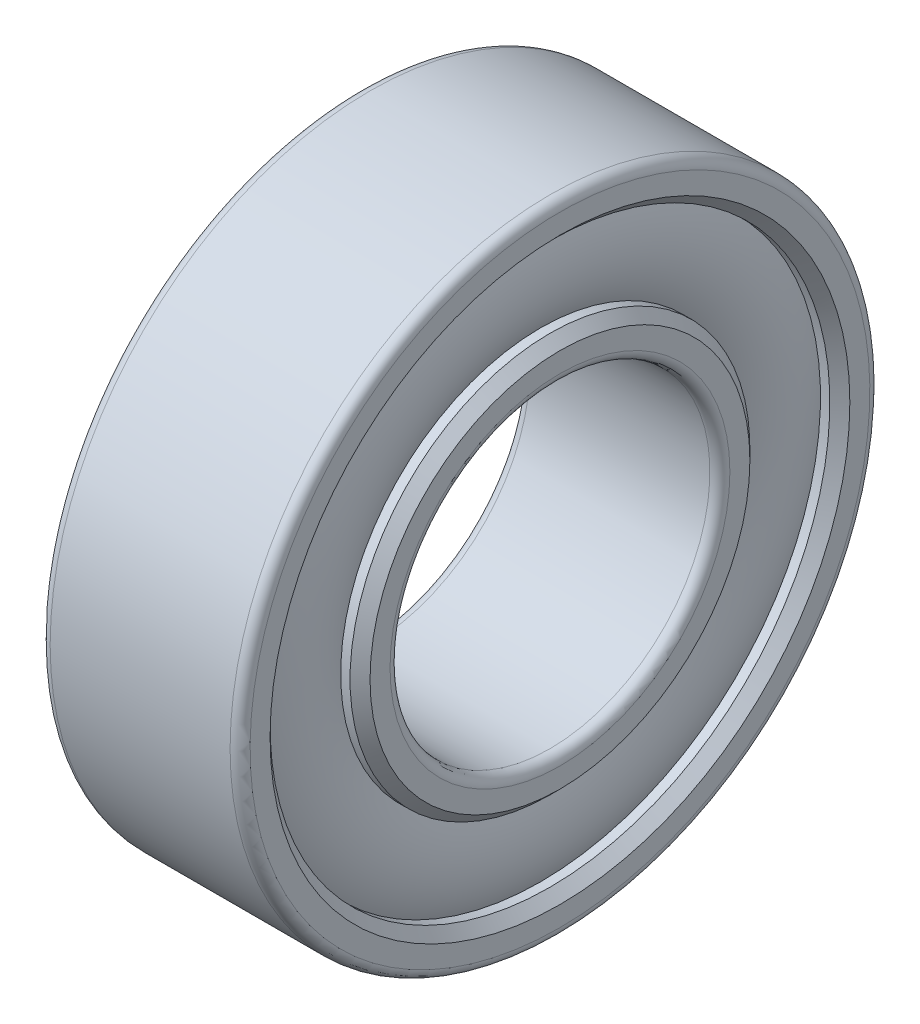
ISO-10303-21;
HEADER;
FILE_DESCRIPTION(('STEP AP214'),'2;1');
FILE_NAME('part.step','',(''),(''),'','','');
FILE_SCHEMA(('AUTOMOTIVE_DESIGN { 1 0 10303 214 1 1 1 1 }'));
ENDSEC;
DATA;
#1=APPLICATION_CONTEXT('core data for automotive mechanical design processes');
#2=APPLICATION_PROTOCOL_DEFINITION('international standard','automotive_design',2000,#1);
#3=PRODUCT_CONTEXT('',#1,'mechanical');
#4=PRODUCT('Part','Part','',(#3));
#5=PRODUCT_RELATED_PRODUCT_CATEGORY('part','',(#4));
#6=PRODUCT_DEFINITION_FORMATION('','',#4);
#7=PRODUCT_DEFINITION_CONTEXT('part definition',#1,'design');
#8=PRODUCT_DEFINITION('design','',#6,#7);
#9=PRODUCT_DEFINITION_SHAPE('','',#8);
#10=(LENGTH_UNIT() NAMED_UNIT(*) SI_UNIT(.MILLI.,.METRE.));
#11=(NAMED_UNIT(*) PLANE_ANGLE_UNIT() SI_UNIT($,.RADIAN.));
#12=(NAMED_UNIT(*) SI_UNIT($,.STERADIAN.) SOLID_ANGLE_UNIT());
#13=UNCERTAINTY_MEASURE_WITH_UNIT(LENGTH_MEASURE(1.E-05),#10,'distance_accuracy_value','');
#14=(GEOMETRIC_REPRESENTATION_CONTEXT(3) GLOBAL_UNCERTAINTY_ASSIGNED_CONTEXT((#13)) GLOBAL_UNIT_ASSIGNED_CONTEXT((#10,
#11,#12)) REPRESENTATION_CONTEXT('',''));
#15=CARTESIAN_POINT('',(0.,0.,0.));
#16=DIRECTION('',(0.,0.,1.));
#17=DIRECTION('',(1.,0.,0.));
#18=AXIS2_PLACEMENT_3D('',#15,#16,#17);
#19=CARTESIAN_POINT('',(2.5,0.,0.));
#20=DIRECTION('',(-1.,0.,0.));
#21=DIRECTION('',(0.,-1.,0.));
#22=AXIS2_PLACEMENT_3D('',#19,#20,#21);
#23=TOROIDAL_SURFACE('',#22,6.,2.25);
#24=CARTESIAN_POINT('',(0.484435562925364,0.,0.));
#25=DIRECTION('',(-1.,0.,0.));
#26=DIRECTION('',(0.,-1.,0.));
#27=AXIS2_PLACEMENT_3D('',#24,#25,#26);
#28=CIRCLE('',#27,7.);
#29=CARTESIAN_POINT('',(0.484435562925363,-7.,0.));
#30=VERTEX_POINT('',#29);
#31=EDGE_CURVE('E10',#30,#30,#28,.T.);
#32=ORIENTED_EDGE('',*,*,#31,.T.);
#33=EDGE_LOOP('',(#32));
#34=FACE_BOUND('',#33,.T.);
#35=CARTESIAN_POINT('',(0.484435562925364,0.,0.));
#36=DIRECTION('',(-1.,0.,0.));
#37=DIRECTION('',(0.,-1.,0.));
#38=AXIS2_PLACEMENT_3D('',#35,#36,#37);
#39=CIRCLE('',#38,5.);
#40=CARTESIAN_POINT('',(0.484435562925363,-5.,0.));
#41=VERTEX_POINT('',#40);
#42=EDGE_CURVE('E97',#41,#41,#39,.T.);
#43=ORIENTED_EDGE('',*,*,#42,.F.);
#44=EDGE_LOOP('',(#43));
#45=FACE_BOUND('',#44,.T.);
#46=ADVANCED_FACE('F33',(#34,#45),#23,.T.);
#47=CARTESIAN_POINT('',(0.,0.,0.));
#48=DIRECTION('',(-1.,0.,0.));
#49=DIRECTION('',(0.,-1.,0.));
#50=AXIS2_PLACEMENT_3D('',#47,#48,#49);
#51=CYLINDRICAL_SURFACE('',#50,7.);
#52=CARTESIAN_POINT('',(0.25,0.,0.));
#53=DIRECTION('',(-1.,0.,0.));
#54=DIRECTION('',(0.,-1.,0.));
#55=AXIS2_PLACEMENT_3D('',#52,#53,#54);
#56=CIRCLE('',#55,7.);
#57=CARTESIAN_POINT('',(0.25,-7.,0.));
#58=VERTEX_POINT('',#57);
#59=EDGE_CURVE('E39',#58,#58,#56,.T.);
#60=ORIENTED_EDGE('',*,*,#59,.T.);
#61=EDGE_LOOP('',(#60));
#62=FACE_BOUND('',#61,.T.);
#63=ORIENTED_EDGE('',*,*,#31,.F.);
#64=EDGE_LOOP('',(#63));
#65=FACE_BOUND('',#64,.T.);
#66=ADVANCED_FACE('F105',(#62,#65),#51,.F.);
#67=CARTESIAN_POINT('',(0.25,0.,0.));
#68=DIRECTION('',(-1.,0.,0.));
#69=DIRECTION('',(0.,-1.,0.));
#70=AXIS2_PLACEMENT_3D('',#67,#68,#69);
#71=CONICAL_SURFACE('',#70,7.,0.785398163397449);
#72=CARTESIAN_POINT('',(0.,0.,0.));
#73=DIRECTION('',(-1.,0.,0.));
#74=DIRECTION('',(0.,-1.,0.));
#75=AXIS2_PLACEMENT_3D('',#72,#73,#74);
#76=CIRCLE('',#75,7.25);
#77=CARTESIAN_POINT('',(0.,-7.25,0.));
#78=VERTEX_POINT('',#77);
#79=EDGE_CURVE('E43',#78,#78,#76,.T.);
#80=ORIENTED_EDGE('',*,*,#79,.T.);
#81=EDGE_LOOP('',(#80));
#82=FACE_BOUND('',#81,.T.);
#83=ORIENTED_EDGE('',*,*,#59,.F.);
#84=EDGE_LOOP('',(#83));
#85=FACE_BOUND('',#84,.T.);
#86=ADVANCED_FACE('F109',(#82,#85),#71,.F.);
#87=CARTESIAN_POINT('',(0.,-7.25,0.));
#88=DIRECTION('',(-1.,0.,0.));
#89=DIRECTION('',(0.,-1.,0.));
#90=AXIS2_PLACEMENT_3D('',#87,#88,#89);
#91=PLANE('',#90);
#92=CARTESIAN_POINT('',(0.,0.,0.));
#93=DIRECTION('',(-1.,0.,0.));
#94=DIRECTION('',(0.,-1.,0.));
#95=AXIS2_PLACEMENT_3D('',#92,#93,#94);
#96=CIRCLE('',#95,7.75);
#97=CARTESIAN_POINT('',(0.,-7.75,0.));
#98=VERTEX_POINT('',#97);
#99=EDGE_CURVE('E47',#98,#98,#96,.T.);
#100=ORIENTED_EDGE('',*,*,#99,.T.);
#101=EDGE_LOOP('',(#100));
#102=FACE_BOUND('',#101,.T.);
#103=ORIENTED_EDGE('',*,*,#79,.F.);
#104=EDGE_LOOP('',(#103));
#105=FACE_BOUND('',#104,.T.);
#106=ADVANCED_FACE('F113',(#102,#105),#91,.T.);
#107=CARTESIAN_POINT('',(0.25,0.,0.));
#108=DIRECTION('',(-1.,0.,0.));
#109=DIRECTION('',(0.,-1.,0.));
#110=AXIS2_PLACEMENT_3D('',#107,#108,#109);
#111=TOROIDAL_SURFACE('',#110,7.75,0.250000000000001);
#112=CARTESIAN_POINT('',(0.25,0.,0.));
#113=DIRECTION('',(-1.,0.,0.));
#114=DIRECTION('',(0.,-1.,0.));
#115=AXIS2_PLACEMENT_3D('',#112,#113,#114);
#116=CIRCLE('',#115,8.);
#117=CARTESIAN_POINT('',(0.25,-8.,0.));
#118=VERTEX_POINT('',#117);
#119=EDGE_CURVE('E52',#118,#118,#116,.T.);
#120=ORIENTED_EDGE('',*,*,#119,.T.);
#121=EDGE_LOOP('',(#120));
#122=FACE_BOUND('',#121,.T.);
#123=ORIENTED_EDGE('',*,*,#99,.F.);
#124=EDGE_LOOP('',(#123));
#125=FACE_BOUND('',#124,.T.);
#126=ADVANCED_FACE('F120',(#122,#125),#111,.T.);
#127=CARTESIAN_POINT('',(0.,0.,0.));
#128=DIRECTION('',(-1.,0.,0.));
#129=DIRECTION('',(0.,-1.,0.));
#130=AXIS2_PLACEMENT_3D('',#127,#128,#129);
#131=CYLINDRICAL_SURFACE('',#130,8.);
#132=CARTESIAN_POINT('',(4.75,0.,0.));
#133=DIRECTION('',(-1.,0.,0.));
#134=DIRECTION('',(0.,-1.,0.));
#135=AXIS2_PLACEMENT_3D('',#132,#133,#134);
#136=CIRCLE('',#135,8.);
#137=CARTESIAN_POINT('',(4.75,-8.,0.));
#138=VERTEX_POINT('',#137);
#139=EDGE_CURVE('E55',#138,#138,#136,.T.);
#140=ORIENTED_EDGE('',*,*,#139,.T.);
#141=EDGE_LOOP('',(#140));
#142=FACE_BOUND('',#141,.T.);
#143=ORIENTED_EDGE('',*,*,#119,.F.);
#144=EDGE_LOOP('',(#143));
#145=FACE_BOUND('',#144,.T.);
#146=ADVANCED_FACE('F124',(#142,#145),#131,.T.);
#147=CARTESIAN_POINT('',(4.75,0.,0.));
#148=DIRECTION('',(-1.,0.,0.));
#149=DIRECTION('',(0.,-1.,0.));
#150=AXIS2_PLACEMENT_3D('',#147,#148,#149);
#151=TOROIDAL_SURFACE('',#150,7.75,0.250000000000001);
#152=CARTESIAN_POINT('',(5.,0.,0.));
#153=DIRECTION('',(-1.,0.,0.));
#154=DIRECTION('',(0.,-1.,0.));
#155=AXIS2_PLACEMENT_3D('',#152,#153,#154);
#156=CIRCLE('',#155,7.75);
#157=CARTESIAN_POINT('',(5.,-7.75,0.));
#158=VERTEX_POINT('',#157);
#159=EDGE_CURVE('E58',#158,#158,#156,.T.);
#160=ORIENTED_EDGE('',*,*,#159,.T.);
#161=EDGE_LOOP('',(#160));
#162=FACE_BOUND('',#161,.T.);
#163=ORIENTED_EDGE('',*,*,#139,.F.);
#164=EDGE_LOOP('',(#163));
#165=FACE_BOUND('',#164,.T.);
#166=ADVANCED_FACE('F128',(#162,#165),#151,.T.);
#167=CARTESIAN_POINT('',(5.,-7.25,0.));
#168=DIRECTION('',(1.,0.,0.));
#169=DIRECTION('',(0.,1.,0.));
#170=AXIS2_PLACEMENT_3D('',#167,#168,#169);
#171=PLANE('',#170);
#172=CARTESIAN_POINT('',(5.,0.,0.));
#173=DIRECTION('',(-1.,0.,0.));
#174=DIRECTION('',(0.,-1.,0.));
#175=AXIS2_PLACEMENT_3D('',#172,#173,#174);
#176=CIRCLE('',#175,7.25);
#177=CARTESIAN_POINT('',(5.,-7.25,0.));
#178=VERTEX_POINT('',#177);
#179=EDGE_CURVE('E61',#178,#178,#176,.T.);
#180=ORIENTED_EDGE('',*,*,#179,.T.);
#181=EDGE_LOOP('',(#180));
#182=FACE_BOUND('',#181,.T.);
#183=ORIENTED_EDGE('',*,*,#159,.F.);
#184=EDGE_LOOP('',(#183));
#185=FACE_BOUND('',#184,.T.);
#186=ADVANCED_FACE('F132',(#182,#185),#171,.T.);
#187=CARTESIAN_POINT('',(5.,0.,0.));
#188=DIRECTION('',(1.,0.,0.));
#189=DIRECTION('',(0.,1.,0.));
#190=AXIS2_PLACEMENT_3D('',#187,#188,#189);
#191=CONICAL_SURFACE('',#190,7.25,0.785398163397448);
#192=CARTESIAN_POINT('',(4.75,0.,0.));
#193=DIRECTION('',(-1.,0.,0.));
#194=DIRECTION('',(0.,-1.,0.));
#195=AXIS2_PLACEMENT_3D('',#192,#193,#194);
#196=CIRCLE('',#195,7.);
#197=CARTESIAN_POINT('',(4.75,-7.,0.));
#198=VERTEX_POINT('',#197);
#199=EDGE_CURVE('E64',#198,#198,#196,.T.);
#200=ORIENTED_EDGE('',*,*,#199,.T.);
#201=EDGE_LOOP('',(#200));
#202=FACE_BOUND('',#201,.T.);
#203=ORIENTED_EDGE('',*,*,#179,.F.);
#204=EDGE_LOOP('',(#203));
#205=FACE_BOUND('',#204,.T.);
#206=ADVANCED_FACE('F136',(#202,#205),#191,.F.);
#207=CARTESIAN_POINT('',(0.,0.,0.));
#208=DIRECTION('',(-1.,0.,0.));
#209=DIRECTION('',(0.,-1.,0.));
#210=AXIS2_PLACEMENT_3D('',#207,#208,#209);
#211=CYLINDRICAL_SURFACE('',#210,7.);
#212=CARTESIAN_POINT('',(4.51556443707464,0.,0.));
#213=DIRECTION('',(-1.,0.,0.));
#214=DIRECTION('',(0.,-1.,0.));
#215=AXIS2_PLACEMENT_3D('',#212,#213,#214);
#216=CIRCLE('',#215,7.);
#217=CARTESIAN_POINT('',(4.51556443707464,-7.,0.));
#218=VERTEX_POINT('',#217);
#219=EDGE_CURVE('E67',#218,#218,#216,.T.);
#220=ORIENTED_EDGE('',*,*,#219,.T.);
#221=EDGE_LOOP('',(#220));
#222=FACE_BOUND('',#221,.T.);
#223=ORIENTED_EDGE('',*,*,#199,.F.);
#224=EDGE_LOOP('',(#223));
#225=FACE_BOUND('',#224,.T.);
#226=ADVANCED_FACE('F140',(#222,#225),#211,.F.);
#227=CARTESIAN_POINT('',(2.5,0.,0.));
#228=DIRECTION('',(-1.,0.,0.));
#229=DIRECTION('',(0.,-1.,0.));
#230=AXIS2_PLACEMENT_3D('',#227,#228,#229);
#231=TOROIDAL_SURFACE('',#230,6.,2.25);
#232=CARTESIAN_POINT('',(4.51556443707464,0.,0.));
#233=DIRECTION('',(-1.,0.,0.));
#234=DIRECTION('',(0.,-1.,0.));
#235=AXIS2_PLACEMENT_3D('',#232,#233,#234);
#236=CIRCLE('',#235,5.);
#237=CARTESIAN_POINT('',(4.51556443707464,-5.,0.));
#238=VERTEX_POINT('',#237);
#239=EDGE_CURVE('E70',#238,#238,#236,.T.);
#240=ORIENTED_EDGE('',*,*,#239,.T.);
#241=EDGE_LOOP('',(#240));
#242=FACE_BOUND('',#241,.T.);
#243=ORIENTED_EDGE('',*,*,#219,.F.);
#244=EDGE_LOOP('',(#243));
#245=FACE_BOUND('',#244,.T.);
#246=ADVANCED_FACE('F144',(#242,#245),#231,.T.);
#247=CARTESIAN_POINT('',(0.,0.,0.));
#248=DIRECTION('',(-1.,0.,0.));
#249=DIRECTION('',(0.,-1.,0.));
#250=AXIS2_PLACEMENT_3D('',#247,#248,#249);
#251=CYLINDRICAL_SURFACE('',#250,5.);
#252=CARTESIAN_POINT('',(4.75,0.,0.));
#253=DIRECTION('',(-1.,0.,0.));
#254=DIRECTION('',(0.,-1.,0.));
#255=AXIS2_PLACEMENT_3D('',#252,#253,#254);
#256=CIRCLE('',#255,5.);
#257=CARTESIAN_POINT('',(4.75,-5.,0.));
#258=VERTEX_POINT('',#257);
#259=EDGE_CURVE('E73',#258,#258,#256,.T.);
#260=ORIENTED_EDGE('',*,*,#259,.T.);
#261=EDGE_LOOP('',(#260));
#262=FACE_BOUND('',#261,.T.);
#263=ORIENTED_EDGE('',*,*,#239,.F.);
#264=EDGE_LOOP('',(#263));
#265=FACE_BOUND('',#264,.T.);
#266=ADVANCED_FACE('F148',(#262,#265),#251,.T.);
#267=CARTESIAN_POINT('',(4.75,0.,0.));
#268=DIRECTION('',(-1.,0.,0.));
#269=DIRECTION('',(0.,-1.,0.));
#270=AXIS2_PLACEMENT_3D('',#267,#268,#269);
#271=CONICAL_SURFACE('',#270,5.,0.785398163397448);
#272=CARTESIAN_POINT('',(5.,0.,0.));
#273=DIRECTION('',(-1.,0.,0.));
#274=DIRECTION('',(0.,-1.,0.));
#275=AXIS2_PLACEMENT_3D('',#272,#273,#274);
#276=CIRCLE('',#275,4.75);
#277=CARTESIAN_POINT('',(5.,-4.75,0.));
#278=VERTEX_POINT('',#277);
#279=EDGE_CURVE('E76',#278,#278,#276,.T.);
#280=ORIENTED_EDGE('',*,*,#279,.T.);
#281=EDGE_LOOP('',(#280));
#282=FACE_BOUND('',#281,.T.);
#283=ORIENTED_EDGE('',*,*,#259,.F.);
#284=EDGE_LOOP('',(#283));
#285=FACE_BOUND('',#284,.T.);
#286=ADVANCED_FACE('F152',(#282,#285),#271,.T.);
#287=CARTESIAN_POINT('',(5.,-4.25,0.));
#288=DIRECTION('',(1.,0.,0.));
#289=DIRECTION('',(0.,1.,0.));
#290=AXIS2_PLACEMENT_3D('',#287,#288,#289);
#291=PLANE('',#290);
#292=CARTESIAN_POINT('',(5.,0.,0.));
#293=DIRECTION('',(-1.,0.,0.));
#294=DIRECTION('',(0.,-1.,0.));
#295=AXIS2_PLACEMENT_3D('',#292,#293,#294);
#296=CIRCLE('',#295,4.25);
#297=CARTESIAN_POINT('',(5.,-4.25,0.));
#298=VERTEX_POINT('',#297);
#299=EDGE_CURVE('E79',#298,#298,#296,.T.);
#300=ORIENTED_EDGE('',*,*,#299,.T.);
#301=EDGE_LOOP('',(#300));
#302=FACE_BOUND('',#301,.T.);
#303=ORIENTED_EDGE('',*,*,#279,.F.);
#304=EDGE_LOOP('',(#303));
#305=FACE_BOUND('',#304,.T.);
#306=ADVANCED_FACE('F156',(#302,#305),#291,.T.);
#307=CARTESIAN_POINT('',(4.75,0.,0.));
#308=DIRECTION('',(-1.,0.,0.));
#309=DIRECTION('',(0.,-1.,0.));
#310=AXIS2_PLACEMENT_3D('',#307,#308,#309);
#311=TOROIDAL_SURFACE('',#310,4.25,0.25);
#312=CARTESIAN_POINT('',(4.75,0.,0.));
#313=DIRECTION('',(-1.,0.,0.));
#314=DIRECTION('',(0.,-1.,0.));
#315=AXIS2_PLACEMENT_3D('',#312,#313,#314);
#316=CIRCLE('',#315,4.);
#317=CARTESIAN_POINT('',(4.75,-4.,0.));
#318=VERTEX_POINT('',#317);
#319=EDGE_CURVE('E82',#318,#318,#316,.T.);
#320=ORIENTED_EDGE('',*,*,#319,.T.);
#321=EDGE_LOOP('',(#320));
#322=FACE_BOUND('',#321,.T.);
#323=ORIENTED_EDGE('',*,*,#299,.F.);
#324=EDGE_LOOP('',(#323));
#325=FACE_BOUND('',#324,.T.);
#326=ADVANCED_FACE('F160',(#322,#325),#311,.T.);
#327=CARTESIAN_POINT('',(0.,0.,0.));
#328=DIRECTION('',(-1.,0.,0.));
#329=DIRECTION('',(0.,-1.,0.));
#330=AXIS2_PLACEMENT_3D('',#327,#328,#329);
#331=CYLINDRICAL_SURFACE('',#330,4.);
#332=CARTESIAN_POINT('',(0.25,0.,0.));
#333=DIRECTION('',(-1.,0.,0.));
#334=DIRECTION('',(0.,-1.,0.));
#335=AXIS2_PLACEMENT_3D('',#332,#333,#334);
#336=CIRCLE('',#335,4.);
#337=CARTESIAN_POINT('',(0.25,-4.,0.));
#338=VERTEX_POINT('',#337);
#339=EDGE_CURVE('E85',#338,#338,#336,.T.);
#340=ORIENTED_EDGE('',*,*,#339,.T.);
#341=EDGE_LOOP('',(#340));
#342=FACE_BOUND('',#341,.T.);
#343=ORIENTED_EDGE('',*,*,#319,.F.);
#344=EDGE_LOOP('',(#343));
#345=FACE_BOUND('',#344,.T.);
#346=ADVANCED_FACE('F164',(#342,#345),#331,.F.);
#347=CARTESIAN_POINT('',(0.25,0.,0.));
#348=DIRECTION('',(-1.,0.,0.));
#349=DIRECTION('',(0.,-1.,0.));
#350=AXIS2_PLACEMENT_3D('',#347,#348,#349);
#351=TOROIDAL_SURFACE('',#350,4.25,0.25);
#352=CARTESIAN_POINT('',(0.,0.,0.));
#353=DIRECTION('',(-1.,0.,0.));
#354=DIRECTION('',(0.,-1.,0.));
#355=AXIS2_PLACEMENT_3D('',#352,#353,#354);
#356=CIRCLE('',#355,4.25);
#357=CARTESIAN_POINT('',(0.,-4.25,0.));
#358=VERTEX_POINT('',#357);
#359=EDGE_CURVE('E88',#358,#358,#356,.T.);
#360=ORIENTED_EDGE('',*,*,#359,.T.);
#361=EDGE_LOOP('',(#360));
#362=FACE_BOUND('',#361,.T.);
#363=ORIENTED_EDGE('',*,*,#339,.F.);
#364=EDGE_LOOP('',(#363));
#365=FACE_BOUND('',#364,.T.);
#366=ADVANCED_FACE('F168',(#362,#365),#351,.T.);
#367=CARTESIAN_POINT('',(0.,-4.25,0.));
#368=DIRECTION('',(-1.,0.,0.));
#369=DIRECTION('',(0.,-1.,0.));
#370=AXIS2_PLACEMENT_3D('',#367,#368,#369);
#371=PLANE('',#370);
#372=CARTESIAN_POINT('',(0.,0.,0.));
#373=DIRECTION('',(-1.,0.,0.));
#374=DIRECTION('',(0.,-1.,0.));
#375=AXIS2_PLACEMENT_3D('',#372,#373,#374);
#376=CIRCLE('',#375,4.75);
#377=CARTESIAN_POINT('',(0.,-4.75,0.));
#378=VERTEX_POINT('',#377);
#379=EDGE_CURVE('E91',#378,#378,#376,.T.);
#380=ORIENTED_EDGE('',*,*,#379,.T.);
#381=EDGE_LOOP('',(#380));
#382=FACE_BOUND('',#381,.T.);
#383=ORIENTED_EDGE('',*,*,#359,.F.);
#384=EDGE_LOOP('',(#383));
#385=FACE_BOUND('',#384,.T.);
#386=ADVANCED_FACE('F172',(#382,#385),#371,.T.);
#387=CARTESIAN_POINT('',(0.,0.,0.));
#388=DIRECTION('',(1.,0.,0.));
#389=DIRECTION('',(0.,1.,0.));
#390=AXIS2_PLACEMENT_3D('',#387,#388,#389);
#391=CONICAL_SURFACE('',#390,4.75,0.785398163397448);
#392=CARTESIAN_POINT('',(0.25,0.,0.));
#393=DIRECTION('',(-1.,0.,0.));
#394=DIRECTION('',(0.,-1.,0.));
#395=AXIS2_PLACEMENT_3D('',#392,#393,#394);
#396=CIRCLE('',#395,5.);
#397=CARTESIAN_POINT('',(0.25,-5.,0.));
#398=VERTEX_POINT('',#397);
#399=EDGE_CURVE('E94',#398,#398,#396,.T.);
#400=ORIENTED_EDGE('',*,*,#399,.T.);
#401=EDGE_LOOP('',(#400));
#402=FACE_BOUND('',#401,.T.);
#403=ORIENTED_EDGE('',*,*,#379,.F.);
#404=EDGE_LOOP('',(#403));
#405=FACE_BOUND('',#404,.T.);
#406=ADVANCED_FACE('F176',(#402,#405),#391,.T.);
#407=CARTESIAN_POINT('',(0.,0.,0.));
#408=DIRECTION('',(-1.,0.,0.));
#409=DIRECTION('',(0.,-1.,0.));
#410=AXIS2_PLACEMENT_3D('',#407,#408,#409);
#411=CYLINDRICAL_SURFACE('',#410,5.);
#412=ORIENTED_EDGE('',*,*,#42,.T.);
#413=EDGE_LOOP('',(#412));
#414=FACE_BOUND('',#413,.T.);
#415=ORIENTED_EDGE('',*,*,#399,.F.);
#416=EDGE_LOOP('',(#415));
#417=FACE_BOUND('',#416,.T.);
#418=ADVANCED_FACE('F101',(#414,#417),#411,.T.);
#419=CLOSED_SHELL('',(#46,#66,#86,#106,#126,#146,#166,#186,#206,#226,#246,#266,#286,#306,#326,
#346,#366,#386,#406,#418));
#420=MANIFOLD_SOLID_BREP('B2',#419);
#421=ADVANCED_BREP_SHAPE_REPRESENTATION('',(#18,#420),#14);
#422=SHAPE_DEFINITION_REPRESENTATION(#9,#421);
ENDSEC;
END-ISO-10303-21;
